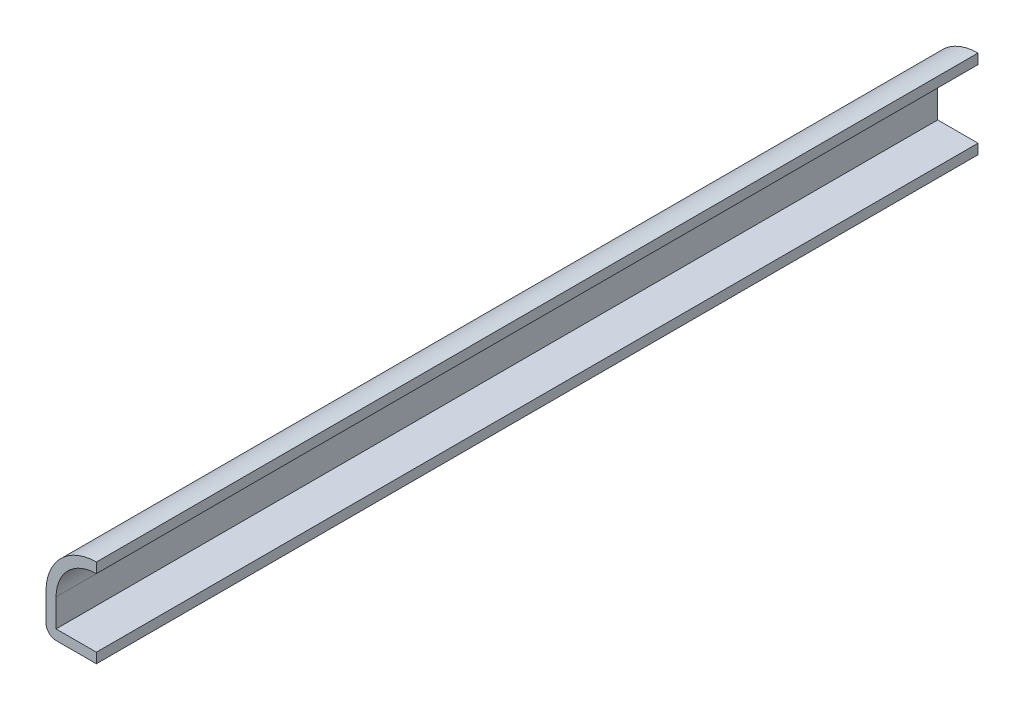
ISO-10303-21;
HEADER;
FILE_DESCRIPTION(('STEP AP214'),'2;1');
FILE_NAME('part.step','',(''),(''),'','','');
FILE_SCHEMA(('AUTOMOTIVE_DESIGN { 1 0 10303 214 1 1 1 1 }'));
ENDSEC;
DATA;
#1=APPLICATION_CONTEXT('core data for automotive mechanical design processes');
#2=APPLICATION_PROTOCOL_DEFINITION('international standard','automotive_design',2000,#1);
#3=PRODUCT_CONTEXT('',#1,'mechanical');
#4=PRODUCT('Part','Part','',(#3));
#5=PRODUCT_RELATED_PRODUCT_CATEGORY('part','',(#4));
#6=PRODUCT_DEFINITION_FORMATION('','',#4);
#7=PRODUCT_DEFINITION_CONTEXT('part definition',#1,'design');
#8=PRODUCT_DEFINITION('design','',#6,#7);
#9=PRODUCT_DEFINITION_SHAPE('','',#8);
#10=(LENGTH_UNIT() NAMED_UNIT(*) SI_UNIT(.MILLI.,.METRE.));
#11=(NAMED_UNIT(*) PLANE_ANGLE_UNIT() SI_UNIT($,.RADIAN.));
#12=(NAMED_UNIT(*) SI_UNIT($,.STERADIAN.) SOLID_ANGLE_UNIT());
#13=UNCERTAINTY_MEASURE_WITH_UNIT(LENGTH_MEASURE(1.E-05),#10,'distance_accuracy_value','');
#14=(GEOMETRIC_REPRESENTATION_CONTEXT(3) GLOBAL_UNCERTAINTY_ASSIGNED_CONTEXT((#13)) GLOBAL_UNIT_ASSIGNED_CONTEXT((#10,
#11,#12)) REPRESENTATION_CONTEXT('',''));
#15=CARTESIAN_POINT('',(0.,0.,0.));
#16=DIRECTION('',(0.,0.,1.));
#17=DIRECTION('',(1.,0.,0.));
#18=AXIS2_PLACEMENT_3D('',#15,#16,#17);
#19=CARTESIAN_POINT('',(0.,4.7625,-111.125));
#20=DIRECTION('',(0.,0.,1.));
#21=DIRECTION('',(1.,0.,0.));
#22=AXIS2_PLACEMENT_3D('',#19,#20,#21);
#23=CYLINDRICAL_SURFACE('',#22,5.08);
#24=CARTESIAN_POINT('',(0.,4.7625,0.));
#25=DIRECTION('',(0.,0.,1.));
#26=DIRECTION('',(1.,0.,0.));
#27=AXIS2_PLACEMENT_3D('',#24,#25,#26);
#28=CIRCLE('',#27,5.08);
#29=CARTESIAN_POINT('',(-5.08,4.7625,0.));
#30=VERTEX_POINT('',#29);
#31=CARTESIAN_POINT('',(0.,9.8425,0.));
#32=VERTEX_POINT('',#31);
#33=EDGE_CURVE('E148',#30,#32,#28,.F.);
#34=ORIENTED_EDGE('',*,*,#33,.F.);
#35=DIRECTION('',(0.,0.,1.));
#36=VECTOR('',#35,1.);
#37=CARTESIAN_POINT('',(-5.08,4.7625,-111.125));
#38=LINE('',#37,#36);
#39=CARTESIAN_POINT('',(-5.08,4.7625,-111.125));
#40=VERTEX_POINT('',#39);
#41=EDGE_CURVE('E130',#40,#30,#38,.T.);
#42=ORIENTED_EDGE('',*,*,#41,.F.);
#43=CARTESIAN_POINT('',(0.,4.7625,-111.125));
#44=DIRECTION('',(0.,0.,1.));
#45=DIRECTION('',(1.,0.,0.));
#46=AXIS2_PLACEMENT_3D('',#43,#44,#45);
#47=CIRCLE('',#46,5.08);
#48=CARTESIAN_POINT('',(0.,9.8425,-111.125));
#49=VERTEX_POINT('',#48);
#50=EDGE_CURVE('E111',#40,#49,#47,.F.);
#51=ORIENTED_EDGE('',*,*,#50,.T.);
#52=DIRECTION('',(0.,0.,1.));
#53=VECTOR('',#52,1.);
#54=CARTESIAN_POINT('',(0.,9.8425,-111.125));
#55=LINE('',#54,#53);
#56=EDGE_CURVE('E120',#49,#32,#55,.T.);
#57=ORIENTED_EDGE('',*,*,#56,.T.);
#58=EDGE_LOOP('',(#34,#42,#51,#57));
#59=FACE_BOUND('',#58,.T.);
#60=ADVANCED_FACE('F35',(#59),#23,.F.);
#61=CARTESIAN_POINT('',(-5.08,0.,-111.125));
#62=DIRECTION('',(1.,0.,0.));
#63=DIRECTION('',(0.,0.,-1.));
#64=AXIS2_PLACEMENT_3D('',#61,#62,#63);
#65=PLANE('',#64);
#66=DIRECTION('',(0.,1.,0.));
#67=VECTOR('',#66,1.);
#68=CARTESIAN_POINT('',(-5.08,0.,0.));
#69=LINE('',#68,#67);
#70=CARTESIAN_POINT('',(-5.08,1.27,0.));
#71=VERTEX_POINT('',#70);
#72=EDGE_CURVE('E131',#71,#30,#69,.T.);
#73=ORIENTED_EDGE('',*,*,#72,.F.);
#74=DIRECTION('',(0.,0.,1.));
#75=VECTOR('',#74,1.);
#76=CARTESIAN_POINT('',(-5.08,1.27,-111.125));
#77=LINE('',#76,#75);
#78=CARTESIAN_POINT('',(-5.08,1.27,-111.125));
#79=VERTEX_POINT('',#78);
#80=EDGE_CURVE('E163',#79,#71,#77,.T.);
#81=ORIENTED_EDGE('',*,*,#80,.F.);
#82=DIRECTION('',(0.,1.,0.));
#83=VECTOR('',#82,1.);
#84=CARTESIAN_POINT('',(-5.08,0.,-111.125));
#85=LINE('',#84,#83);
#86=EDGE_CURVE('E128',#79,#40,#85,.T.);
#87=ORIENTED_EDGE('',*,*,#86,.T.);
#88=ORIENTED_EDGE('',*,*,#41,.T.);
#89=EDGE_LOOP('',(#73,#81,#87,#88));
#90=FACE_BOUND('',#89,.T.);
#91=ADVANCED_FACE('F197',(#90),#65,.T.);
#92=CARTESIAN_POINT('',(0.,1.27,-111.125));
#93=DIRECTION('',(0.,1.,0.));
#94=DIRECTION('',(-1.,0.,0.));
#95=AXIS2_PLACEMENT_3D('',#92,#93,#94);
#96=PLANE('',#95);
#97=DIRECTION('',(-1.,0.,0.));
#98=VECTOR('',#97,1.);
#99=CARTESIAN_POINT('',(0.,1.27,0.));
#100=LINE('',#99,#98);
#101=CARTESIAN_POINT('',(0.,1.27,0.));
#102=VERTEX_POINT('',#101);
#103=EDGE_CURVE('E134',#102,#71,#100,.T.);
#104=ORIENTED_EDGE('',*,*,#103,.F.);
#105=DIRECTION('',(0.,0.,1.));
#106=VECTOR('',#105,1.);
#107=CARTESIAN_POINT('',(0.,1.27,-111.125));
#108=LINE('',#107,#106);
#109=CARTESIAN_POINT('',(0.,1.27,-111.125));
#110=VERTEX_POINT('',#109);
#111=EDGE_CURVE('E165',#110,#102,#108,.T.);
#112=ORIENTED_EDGE('',*,*,#111,.F.);
#113=DIRECTION('',(-1.,0.,0.));
#114=VECTOR('',#113,1.);
#115=CARTESIAN_POINT('',(0.,1.27,-111.125));
#116=LINE('',#115,#114);
#117=EDGE_CURVE('E144',#110,#79,#116,.T.);
#118=ORIENTED_EDGE('',*,*,#117,.T.);
#119=ORIENTED_EDGE('',*,*,#80,.T.);
#120=EDGE_LOOP('',(#104,#112,#118,#119));
#121=FACE_BOUND('',#120,.T.);
#122=ADVANCED_FACE('F201',(#121),#96,.T.);
#123=CARTESIAN_POINT('',(0.,1.27,-111.125));
#124=DIRECTION('',(-1.,0.,0.));
#125=DIRECTION('',(0.,-1.,0.));
#126=AXIS2_PLACEMENT_3D('',#123,#124,#125);
#127=PLANE('',#126);
#128=DIRECTION('',(0.,-1.,0.));
#129=VECTOR('',#128,1.);
#130=CARTESIAN_POINT('',(0.,1.27,0.));
#131=LINE('',#130,#129);
#132=CARTESIAN_POINT('',(0.,0.,0.));
#133=VERTEX_POINT('',#132);
#134=EDGE_CURVE('E157',#102,#133,#131,.T.);
#135=ORIENTED_EDGE('',*,*,#134,.T.);
#136=DIRECTION('',(0.,0.,1.));
#137=VECTOR('',#136,1.);
#138=CARTESIAN_POINT('',(0.,0.,-111.125));
#139=LINE('',#138,#137);
#140=CARTESIAN_POINT('',(0.,0.,-111.125));
#141=VERTEX_POINT('',#140);
#142=EDGE_CURVE('E167',#141,#133,#139,.T.);
#143=ORIENTED_EDGE('',*,*,#142,.F.);
#144=DIRECTION('',(0.,-1.,0.));
#145=VECTOR('',#144,1.);
#146=CARTESIAN_POINT('',(0.,1.27,-111.125));
#147=LINE('',#146,#145);
#148=EDGE_CURVE('E142',#110,#141,#147,.T.);
#149=ORIENTED_EDGE('',*,*,#148,.F.);
#150=ORIENTED_EDGE('',*,*,#111,.T.);
#151=EDGE_LOOP('',(#135,#143,#149,#150));
#152=FACE_BOUND('',#151,.T.);
#153=ADVANCED_FACE('F207',(#152),#127,.F.);
#154=CARTESIAN_POINT('',(0.,0.,-111.125));
#155=DIRECTION('',(0.,1.,0.));
#156=DIRECTION('',(-1.,0.,0.));
#157=AXIS2_PLACEMENT_3D('',#154,#155,#156);
#158=PLANE('',#157);
#159=DIRECTION('',(-1.,0.,0.));
#160=VECTOR('',#159,1.);
#161=CARTESIAN_POINT('',(0.,0.,0.));
#162=LINE('',#161,#160);
#163=CARTESIAN_POINT('',(-5.08,0.,0.));
#164=VERTEX_POINT('',#163);
#165=EDGE_CURVE('E155',#133,#164,#162,.T.);
#166=ORIENTED_EDGE('',*,*,#165,.T.);
#167=DIRECTION('',(0.,0.,1.));
#168=VECTOR('',#167,1.);
#169=CARTESIAN_POINT('',(-5.08,0.,-111.125));
#170=LINE('',#169,#168);
#171=CARTESIAN_POINT('',(-5.08,0.,-111.125));
#172=VERTEX_POINT('',#171);
#173=EDGE_CURVE('E43',#164,#172,#170,.F.);
#174=ORIENTED_EDGE('',*,*,#173,.T.);
#175=DIRECTION('',(-1.,0.,0.));
#176=VECTOR('',#175,1.);
#177=CARTESIAN_POINT('',(0.,0.,-111.125));
#178=LINE('',#177,#176);
#179=EDGE_CURVE('E140',#141,#172,#178,.T.);
#180=ORIENTED_EDGE('',*,*,#179,.F.);
#181=ORIENTED_EDGE('',*,*,#142,.T.);
#182=EDGE_LOOP('',(#166,#174,#180,#181));
#183=FACE_BOUND('',#182,.T.);
#184=ADVANCED_FACE('F194',(#183),#158,.F.);
#185=CARTESIAN_POINT('',(-6.35,0.,-111.125));
#186=DIRECTION('',(1.,0.,0.));
#187=DIRECTION('',(0.,0.,-1.));
#188=AXIS2_PLACEMENT_3D('',#185,#186,#187);
#189=PLANE('',#188);
#190=DIRECTION('',(0.,1.,0.));
#191=VECTOR('',#190,1.);
#192=CARTESIAN_POINT('',(-6.35,0.,-111.125));
#193=LINE('',#192,#191);
#194=CARTESIAN_POINT('',(-6.35,1.27,-111.125));
#195=VERTEX_POINT('',#194);
#196=CARTESIAN_POINT('',(-6.35,4.7625,-111.125));
#197=VERTEX_POINT('',#196);
#198=EDGE_CURVE('E138',#195,#197,#193,.T.);
#199=ORIENTED_EDGE('',*,*,#198,.F.);
#200=DIRECTION('',(0.,0.,1.));
#201=VECTOR('',#200,1.);
#202=CARTESIAN_POINT('',(-6.35,1.27,-111.125));
#203=LINE('',#202,#201);
#204=CARTESIAN_POINT('',(-6.35,1.27,0.));
#205=VERTEX_POINT('',#204);
#206=EDGE_CURVE('E162',#195,#205,#203,.T.);
#207=ORIENTED_EDGE('',*,*,#206,.T.);
#208=DIRECTION('',(0.,1.,0.));
#209=VECTOR('',#208,1.);
#210=CARTESIAN_POINT('',(-6.35,0.,0.));
#211=LINE('',#210,#209);
#212=CARTESIAN_POINT('',(-6.35,4.7625,0.));
#213=VERTEX_POINT('',#212);
#214=EDGE_CURVE('E153',#205,#213,#211,.T.);
#215=ORIENTED_EDGE('',*,*,#214,.T.);
#216=DIRECTION('',(0.,0.,1.));
#217=VECTOR('',#216,1.);
#218=CARTESIAN_POINT('',(-6.35,4.7625,-111.125));
#219=LINE('',#218,#217);
#220=EDGE_CURVE('E170',#197,#213,#219,.T.);
#221=ORIENTED_EDGE('',*,*,#220,.F.);
#222=EDGE_LOOP('',(#199,#207,#215,#221));
#223=FACE_BOUND('',#222,.T.);
#224=ADVANCED_FACE('F179',(#223),#189,.F.);
#225=CARTESIAN_POINT('',(0.,4.7625,-111.125));
#226=DIRECTION('',(0.,0.,1.));
#227=DIRECTION('',(1.,0.,0.));
#228=AXIS2_PLACEMENT_3D('',#225,#226,#227);
#229=CYLINDRICAL_SURFACE('',#228,6.35);
#230=CARTESIAN_POINT('',(0.,4.7625,0.));
#231=DIRECTION('',(0.,0.,-1.));
#232=DIRECTION('',(-1.,0.,0.));
#233=AXIS2_PLACEMENT_3D('',#230,#231,#232);
#234=CIRCLE('',#233,6.35);
#235=CARTESIAN_POINT('',(0.,11.1125,0.));
#236=VERTEX_POINT('',#235);
#237=EDGE_CURVE('E151',#213,#236,#234,.T.);
#238=ORIENTED_EDGE('',*,*,#237,.T.);
#239=DIRECTION('',(0.,0.,1.));
#240=VECTOR('',#239,1.);
#241=CARTESIAN_POINT('',(0.,11.1125,-111.125));
#242=LINE('',#241,#240);
#243=CARTESIAN_POINT('',(0.,11.1125,-111.125));
#244=VERTEX_POINT('',#243);
#245=EDGE_CURVE('E127',#244,#236,#242,.T.);
#246=ORIENTED_EDGE('',*,*,#245,.F.);
#247=CARTESIAN_POINT('',(0.,4.7625,-111.125));
#248=DIRECTION('',(0.,0.,-1.));
#249=DIRECTION('',(-1.,0.,0.));
#250=AXIS2_PLACEMENT_3D('',#247,#248,#249);
#251=CIRCLE('',#250,6.35);
#252=EDGE_CURVE('E114',#197,#244,#251,.T.);
#253=ORIENTED_EDGE('',*,*,#252,.F.);
#254=ORIENTED_EDGE('',*,*,#220,.T.);
#255=EDGE_LOOP('',(#238,#246,#253,#254));
#256=FACE_BOUND('',#255,.T.);
#257=ADVANCED_FACE('F186',(#256),#229,.T.);
#258=CARTESIAN_POINT('',(0.,11.1125,-111.125));
#259=DIRECTION('',(-1.,0.,0.));
#260=DIRECTION('',(0.,-1.,0.));
#261=AXIS2_PLACEMENT_3D('',#258,#259,#260);
#262=PLANE('',#261);
#263=DIRECTION('',(0.,-1.,0.));
#264=VECTOR('',#263,1.);
#265=CARTESIAN_POINT('',(0.,11.1125,0.));
#266=LINE('',#265,#264);
#267=EDGE_CURVE('E123',#236,#32,#266,.T.);
#268=ORIENTED_EDGE('',*,*,#267,.T.);
#269=ORIENTED_EDGE('',*,*,#56,.F.);
#270=DIRECTION('',(0.,-1.,0.));
#271=VECTOR('',#270,1.);
#272=CARTESIAN_POINT('',(0.,11.1125,-111.125));
#273=LINE('',#272,#271);
#274=EDGE_CURVE('E106',#244,#49,#273,.T.);
#275=ORIENTED_EDGE('',*,*,#274,.F.);
#276=ORIENTED_EDGE('',*,*,#245,.T.);
#277=EDGE_LOOP('',(#268,#269,#275,#276));
#278=FACE_BOUND('',#277,.T.);
#279=ADVANCED_FACE('F121',(#278),#262,.F.);
#280=CARTESIAN_POINT('',(0.,4.7625,-111.125));
#281=DIRECTION('',(0.,0.,1.));
#282=DIRECTION('',(1.,0.,0.));
#283=AXIS2_PLACEMENT_3D('',#280,#281,#282);
#284=PLANE('',#283);
#285=ORIENTED_EDGE('',*,*,#179,.T.);
#286=CARTESIAN_POINT('',(-5.08,1.27,-111.125));
#287=DIRECTION('',(0.,0.,1.));
#288=DIRECTION('',(1.,0.,0.));
#289=AXIS2_PLACEMENT_3D('',#286,#287,#288);
#290=CIRCLE('',#289,1.27);
#291=EDGE_CURVE('E11',#172,#195,#290,.F.);
#292=ORIENTED_EDGE('',*,*,#291,.T.);
#293=ORIENTED_EDGE('',*,*,#198,.T.);
#294=ORIENTED_EDGE('',*,*,#252,.T.);
#295=ORIENTED_EDGE('',*,*,#274,.T.);
#296=ORIENTED_EDGE('',*,*,#50,.F.);
#297=ORIENTED_EDGE('',*,*,#86,.F.);
#298=ORIENTED_EDGE('',*,*,#117,.F.);
#299=ORIENTED_EDGE('',*,*,#148,.T.);
#300=EDGE_LOOP('',(#285,#292,#293,#294,#295,#296,#297,#298,#299));
#301=FACE_BOUND('',#300,.T.);
#302=ADVANCED_FACE('F108',(#301),#284,.F.);
#303=CARTESIAN_POINT('',(0.,4.7625,0.));
#304=DIRECTION('',(0.,0.,1.));
#305=DIRECTION('',(1.,0.,0.));
#306=AXIS2_PLACEMENT_3D('',#303,#304,#305);
#307=PLANE('',#306);
#308=ORIENTED_EDGE('',*,*,#214,.F.);
#309=CARTESIAN_POINT('',(-5.08,1.27,0.));
#310=DIRECTION('',(0.,0.,1.));
#311=DIRECTION('',(1.,0.,0.));
#312=AXIS2_PLACEMENT_3D('',#309,#310,#311);
#313=CIRCLE('',#312,1.27);
#314=EDGE_CURVE('E57',#205,#164,#313,.T.);
#315=ORIENTED_EDGE('',*,*,#314,.T.);
#316=ORIENTED_EDGE('',*,*,#165,.F.);
#317=ORIENTED_EDGE('',*,*,#134,.F.);
#318=ORIENTED_EDGE('',*,*,#103,.T.);
#319=ORIENTED_EDGE('',*,*,#72,.T.);
#320=ORIENTED_EDGE('',*,*,#33,.T.);
#321=ORIENTED_EDGE('',*,*,#267,.F.);
#322=ORIENTED_EDGE('',*,*,#237,.F.);
#323=EDGE_LOOP('',(#308,#315,#316,#317,#318,#319,#320,#321,#322));
#324=FACE_BOUND('',#323,.T.);
#325=ADVANCED_FACE('F184',(#324),#307,.T.);
#326=CARTESIAN_POINT('',(-5.08,1.27,-111.125));
#327=DIRECTION('',(0.,0.,1.));
#328=DIRECTION('',(1.,0.,0.));
#329=AXIS2_PLACEMENT_3D('',#326,#327,#328);
#330=CYLINDRICAL_SURFACE('',#329,1.27);
#331=ORIENTED_EDGE('',*,*,#291,.F.);
#332=ORIENTED_EDGE('',*,*,#173,.F.);
#333=ORIENTED_EDGE('',*,*,#314,.F.);
#334=ORIENTED_EDGE('',*,*,#206,.F.);
#335=EDGE_LOOP('',(#331,#332,#333,#334));
#336=FACE_BOUND('',#335,.T.);
#337=ADVANCED_FACE('F37',(#336),#330,.T.);
#338=CLOSED_SHELL('',(#60,#91,#122,#153,#184,#224,#257,#279,#302,#325,#337));
#339=MANIFOLD_SOLID_BREP('B2',#338);
#340=ADVANCED_BREP_SHAPE_REPRESENTATION('',(#18,#339),#14);
#341=SHAPE_DEFINITION_REPRESENTATION(#9,#340);
ENDSEC;
END-ISO-10303-21;
